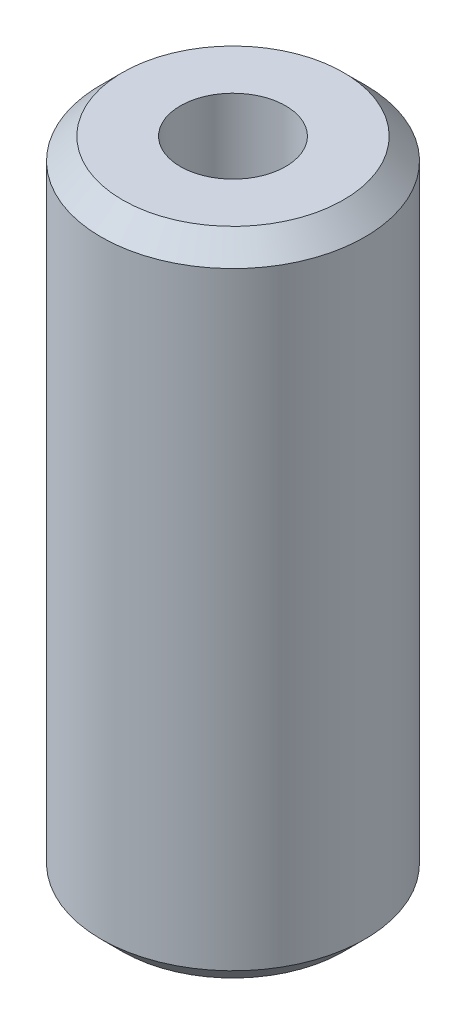
ISO-10303-21;
HEADER;
FILE_DESCRIPTION(('STEP AP214'),'2;1');
FILE_NAME('part.step','',(''),(''),'','','');
FILE_SCHEMA(('AUTOMOTIVE_DESIGN { 1 0 10303 214 1 1 1 1 }'));
ENDSEC;
DATA;
#1=APPLICATION_CONTEXT('core data for automotive mechanical design processes');
#2=APPLICATION_PROTOCOL_DEFINITION('international standard','automotive_design',2000,#1);
#3=PRODUCT_CONTEXT('',#1,'mechanical');
#4=PRODUCT('Part','Part','',(#3));
#5=PRODUCT_RELATED_PRODUCT_CATEGORY('part','',(#4));
#6=PRODUCT_DEFINITION_FORMATION('','',#4);
#7=PRODUCT_DEFINITION_CONTEXT('part definition',#1,'design');
#8=PRODUCT_DEFINITION('design','',#6,#7);
#9=PRODUCT_DEFINITION_SHAPE('','',#8);
#10=(LENGTH_UNIT() NAMED_UNIT(*) SI_UNIT(.MILLI.,.METRE.));
#11=(NAMED_UNIT(*) PLANE_ANGLE_UNIT() SI_UNIT($,.RADIAN.));
#12=(NAMED_UNIT(*) SI_UNIT($,.STERADIAN.) SOLID_ANGLE_UNIT());
#13=UNCERTAINTY_MEASURE_WITH_UNIT(LENGTH_MEASURE(1.E-05),#10,'distance_accuracy_value','');
#14=(GEOMETRIC_REPRESENTATION_CONTEXT(3) GLOBAL_UNCERTAINTY_ASSIGNED_CONTEXT((#13)) GLOBAL_UNIT_ASSIGNED_CONTEXT((#10,
#11,#12)) REPRESENTATION_CONTEXT('',''));
#15=CARTESIAN_POINT('',(0.,0.,0.));
#16=DIRECTION('',(0.,0.,1.));
#17=DIRECTION('',(1.,0.,0.));
#18=AXIS2_PLACEMENT_3D('',#15,#16,#17);
#19=CARTESIAN_POINT('',(0.,135.732648483212,0.));
#20=DIRECTION('',(0.,-1.,0.));
#21=DIRECTION('',(0.,0.,-1.));
#22=AXIS2_PLACEMENT_3D('',#19,#20,#21);
#23=CYLINDRICAL_SURFACE('',#22,27.5);
#24=CARTESIAN_POINT('',(0.,131.265372846235,0.));
#25=DIRECTION('',(0.,1.,0.));
#26=DIRECTION('',(0.,0.,1.));
#27=AXIS2_PLACEMENT_3D('',#24,#25,#26);
#28=CIRCLE('',#27,27.5);
#29=CARTESIAN_POINT('',(0.,131.265372846235,27.5));
#30=VERTEX_POINT('',#29);
#31=EDGE_CURVE('E50',#30,#30,#28,.F.);
#32=ORIENTED_EDGE('',*,*,#31,.T.);
#33=EDGE_LOOP('',(#32));
#34=FACE_BOUND('',#33,.T.);
#35=CARTESIAN_POINT('',(0.,4.46727563697644,0.));
#36=DIRECTION('',(0.,1.,0.));
#37=DIRECTION('',(0.,0.,1.));
#38=AXIS2_PLACEMENT_3D('',#35,#36,#37);
#39=CIRCLE('',#38,27.5);
#40=CARTESIAN_POINT('',(0.,4.46727563697644,27.5));
#41=VERTEX_POINT('',#40);
#42=EDGE_CURVE('E51',#41,#41,#39,.T.);
#43=ORIENTED_EDGE('',*,*,#42,.T.);
#44=EDGE_LOOP('',(#43));
#45=FACE_BOUND('',#44,.T.);
#46=ADVANCED_FACE('F39',(#34,#45),#23,.T.);
#47=CARTESIAN_POINT('',(0.,135.732648483212,0.));
#48=DIRECTION('',(0.,1.,0.));
#49=DIRECTION('',(0.,0.,1.));
#50=AXIS2_PLACEMENT_3D('',#47,#48,#49);
#51=PLANE('',#50);
#52=CARTESIAN_POINT('',(0.,135.732648483212,0.));
#53=DIRECTION('',(0.,1.,0.));
#54=DIRECTION('',(0.,0.,1.));
#55=AXIS2_PLACEMENT_3D('',#52,#53,#54);
#56=CIRCLE('',#55,23.0327243630236);
#57=CARTESIAN_POINT('',(0.,135.732648483212,23.0327243630236));
#58=VERTEX_POINT('',#57);
#59=EDGE_CURVE('E54',#58,#58,#56,.T.);
#60=ORIENTED_EDGE('',*,*,#59,.T.);
#61=EDGE_LOOP('',(#60));
#62=FACE_BOUND('',#61,.T.);
#63=CARTESIAN_POINT('',(0.,135.732648483212,0.));
#64=DIRECTION('',(0.,1.,0.));
#65=DIRECTION('',(0.,0.,1.));
#66=AXIS2_PLACEMENT_3D('',#63,#64,#65);
#67=CIRCLE('',#66,10.9808237457369);
#68=CARTESIAN_POINT('',(0.,135.732648483212,10.9808237457369));
#69=VERTEX_POINT('',#68);
#70=EDGE_CURVE('E58',#69,#69,#67,.T.);
#71=ORIENTED_EDGE('',*,*,#70,.F.);
#72=EDGE_LOOP('',(#71));
#73=FACE_BOUND('',#72,.T.);
#74=ADVANCED_FACE('F69',(#62,#73),#51,.T.);
#75=CARTESIAN_POINT('',(0.,0.,0.));
#76=DIRECTION('',(0.,1.,0.));
#77=DIRECTION('',(0.,0.,1.));
#78=AXIS2_PLACEMENT_3D('',#75,#76,#77);
#79=PLANE('',#78);
#80=CARTESIAN_POINT('',(0.,0.,0.));
#81=DIRECTION('',(0.,1.,0.));
#82=DIRECTION('',(0.,0.,1.));
#83=AXIS2_PLACEMENT_3D('',#80,#81,#82);
#84=CIRCLE('',#83,23.0327243630235);
#85=CARTESIAN_POINT('',(0.,0.,23.0327243630235));
#86=VERTEX_POINT('',#85);
#87=EDGE_CURVE('E10',#86,#86,#84,.F.);
#88=ORIENTED_EDGE('',*,*,#87,.T.);
#89=EDGE_LOOP('',(#88));
#90=FACE_BOUND('',#89,.T.);
#91=CARTESIAN_POINT('',(0.,0.,0.));
#92=DIRECTION('',(0.,1.,0.));
#93=DIRECTION('',(0.,0.,1.));
#94=AXIS2_PLACEMENT_3D('',#91,#92,#93);
#95=CIRCLE('',#94,10.9808237457369);
#96=CARTESIAN_POINT('',(0.,0.,10.9808237457369));
#97=VERTEX_POINT('',#96);
#98=EDGE_CURVE('E63',#97,#97,#95,.T.);
#99=ORIENTED_EDGE('',*,*,#98,.T.);
#100=EDGE_LOOP('',(#99));
#101=FACE_BOUND('',#100,.T.);
#102=ADVANCED_FACE('F75',(#90,#101),#79,.F.);
#103=CARTESIAN_POINT('',(0.,135.732648483212,0.));
#104=DIRECTION('',(0.,-1.,0.));
#105=DIRECTION('',(0.,0.,-1.));
#106=AXIS2_PLACEMENT_3D('',#103,#104,#105);
#107=CYLINDRICAL_SURFACE('',#106,10.9808237457369);
#108=ORIENTED_EDGE('',*,*,#70,.T.);
#109=EDGE_LOOP('',(#108));
#110=FACE_BOUND('',#109,.T.);
#111=ORIENTED_EDGE('',*,*,#98,.F.);
#112=EDGE_LOOP('',(#111));
#113=FACE_BOUND('',#112,.T.);
#114=ADVANCED_FACE('F70',(#110,#113),#107,.F.);
#115=CARTESIAN_POINT('',(0.,135.732648483212,0.));
#116=DIRECTION('',(0.,-1.,0.));
#117=DIRECTION('',(0.,0.,-1.));
#118=AXIS2_PLACEMENT_3D('',#115,#116,#117);
#119=CONICAL_SURFACE('',#118,23.0327243630236,0.785398163397443);
#120=ORIENTED_EDGE('',*,*,#31,.F.);
#121=EDGE_LOOP('',(#120));
#122=FACE_BOUND('',#121,.T.);
#123=ORIENTED_EDGE('',*,*,#59,.F.);
#124=EDGE_LOOP('',(#123));
#125=FACE_BOUND('',#124,.T.);
#126=ADVANCED_FACE('F81',(#122,#125),#119,.T.);
#127=CARTESIAN_POINT('',(0.,4.46727563697644,0.));
#128=DIRECTION('',(0.,1.,0.));
#129=DIRECTION('',(0.,0.,1.));
#130=AXIS2_PLACEMENT_3D('',#127,#128,#129);
#131=CONICAL_SURFACE('',#130,27.5,0.785398163397452);
#132=ORIENTED_EDGE('',*,*,#87,.F.);
#133=EDGE_LOOP('',(#132));
#134=FACE_BOUND('',#133,.T.);
#135=ORIENTED_EDGE('',*,*,#42,.F.);
#136=EDGE_LOOP('',(#135));
#137=FACE_BOUND('',#136,.T.);
#138=ADVANCED_FACE('F45',(#134,#137),#131,.T.);
#139=CLOSED_SHELL('',(#46,#74,#102,#114,#126,#138));
#140=MANIFOLD_SOLID_BREP('B2',#139);
#141=ADVANCED_BREP_SHAPE_REPRESENTATION('',(#18,#140),#14);
#142=SHAPE_DEFINITION_REPRESENTATION(#9,#141);
ENDSEC;
END-ISO-10303-21;
